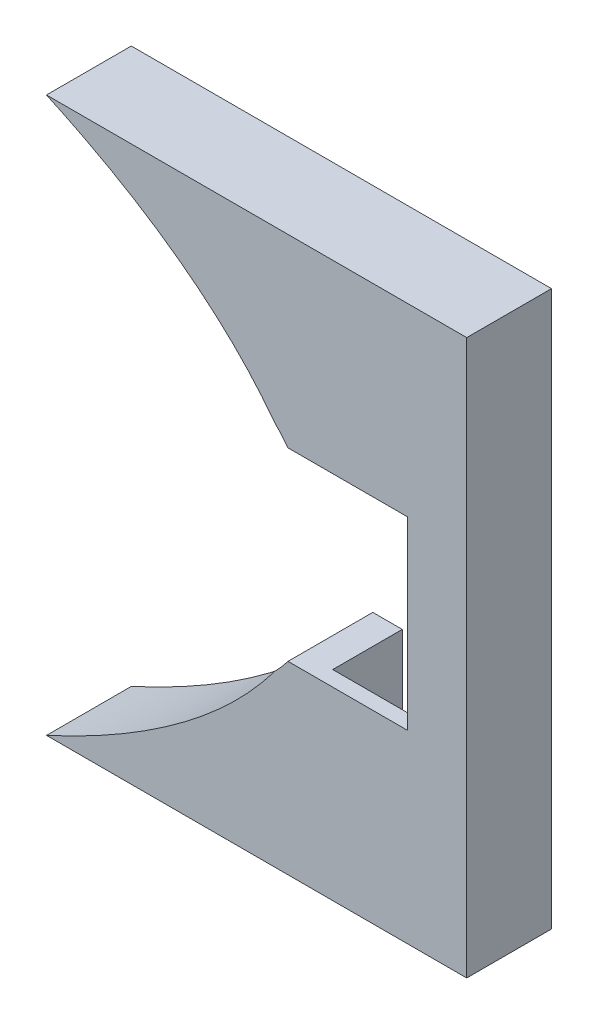
ISO-10303-21;
HEADER;
FILE_DESCRIPTION(('STEP AP214'),'2;1');
FILE_NAME('part.step','',(''),(''),'','','');
FILE_SCHEMA(('AUTOMOTIVE_DESIGN { 1 0 10303 214 1 1 1 1 }'));
ENDSEC;
DATA;
#1=APPLICATION_CONTEXT('core data for automotive mechanical design processes');
#2=APPLICATION_PROTOCOL_DEFINITION('international standard','automotive_design',2000,#1);
#3=PRODUCT_CONTEXT('',#1,'mechanical');
#4=PRODUCT('Part','Part','',(#3));
#5=PRODUCT_RELATED_PRODUCT_CATEGORY('part','',(#4));
#6=PRODUCT_DEFINITION_FORMATION('','',#4);
#7=PRODUCT_DEFINITION_CONTEXT('part definition',#1,'design');
#8=PRODUCT_DEFINITION('design','',#6,#7);
#9=PRODUCT_DEFINITION_SHAPE('','',#8);
#10=(LENGTH_UNIT() NAMED_UNIT(*) SI_UNIT(.MILLI.,.METRE.));
#11=(NAMED_UNIT(*) PLANE_ANGLE_UNIT() SI_UNIT($,.RADIAN.));
#12=(NAMED_UNIT(*) SI_UNIT($,.STERADIAN.) SOLID_ANGLE_UNIT());
#13=UNCERTAINTY_MEASURE_WITH_UNIT(LENGTH_MEASURE(1.E-05),#10,'distance_accuracy_value','');
#14=(GEOMETRIC_REPRESENTATION_CONTEXT(3) GLOBAL_UNCERTAINTY_ASSIGNED_CONTEXT((#13)) GLOBAL_UNIT_ASSIGNED_CONTEXT((#10,
#11,#12)) REPRESENTATION_CONTEXT('',''));
#15=CARTESIAN_POINT('',(0.,0.,0.));
#16=DIRECTION('',(0.,0.,1.));
#17=DIRECTION('',(1.,0.,0.));
#18=AXIS2_PLACEMENT_3D('',#15,#16,#17);
#19=CARTESIAN_POINT('',(55.8,-5.47541809871952E-13,-3.3));
#20=DIRECTION('',(-1.,0.,0.));
#21=DIRECTION('',(0.,-1.,0.));
#22=AXIS2_PLACEMENT_3D('',#19,#20,#21);
#23=PLANE('',#22);
#24=DIRECTION('',(0.,1.,0.));
#25=VECTOR('',#24,1.);
#26=CARTESIAN_POINT('',(55.8,-5.47541809871952E-13,-0.9));
#27=LINE('',#26,#25);
#28=CARTESIAN_POINT('',(55.7999999999998,-14.8500000000006,-0.9));
#29=VERTEX_POINT('',#28);
#30=CARTESIAN_POINT('',(55.8000000000001,-5.44999999999937,-0.9));
#31=VERTEX_POINT('',#30);
#32=EDGE_CURVE('E59',#29,#31,#27,.T.);
#33=ORIENTED_EDGE('',*,*,#32,.F.);
#34=DIRECTION('',(0.,0.,1.));
#35=VECTOR('',#34,1.);
#36=CARTESIAN_POINT('',(55.7999999999998,-14.8500000000006,-3.3));
#37=LINE('',#36,#35);
#38=CARTESIAN_POINT('',(55.7999999999998,-14.8500000000006,-5.));
#39=VERTEX_POINT('',#38);
#40=EDGE_CURVE('E296',#39,#29,#37,.T.);
#41=ORIENTED_EDGE('',*,*,#40,.F.);
#42=DIRECTION('',(0.,1.,0.));
#43=VECTOR('',#42,1.);
#44=CARTESIAN_POINT('',(55.8,-5.47541809871952E-13,-5.));
#45=LINE('',#44,#43);
#46=CARTESIAN_POINT('',(55.7999999999999,-5.44999999999937,-5.));
#47=VERTEX_POINT('',#46);
#48=EDGE_CURVE('E358',#39,#47,#45,.T.);
#49=ORIENTED_EDGE('',*,*,#48,.T.);
#50=DIRECTION('',(0.,0.,1.));
#51=VECTOR('',#50,1.);
#52=CARTESIAN_POINT('',(55.8000000000001,-5.44999999999937,-3.3));
#53=LINE('',#52,#51);
#54=EDGE_CURVE('E55',#47,#31,#53,.T.);
#55=ORIENTED_EDGE('',*,*,#54,.T.);
#56=EDGE_LOOP('',(#33,#41,#49,#55));
#57=FACE_BOUND('',#56,.T.);
#58=ADVANCED_FACE('F37',(#57),#23,.F.);
#59=CARTESIAN_POINT('',(-1.72913909218427E-13,-14.8499999999999,-3.3));
#60=DIRECTION('',(0.,-1.,0.));
#61=DIRECTION('',(1.,0.,0.));
#62=AXIS2_PLACEMENT_3D('',#59,#60,#61);
#63=PLANE('',#62);
#64=DIRECTION('',(-1.,0.,0.));
#65=VECTOR('',#64,1.);
#66=CARTESIAN_POINT('',(-1.72913909218427E-13,-14.8499999999999,-0.9));
#67=LINE('',#66,#65);
#68=CARTESIAN_POINT('',(63.0999999999999,-14.8500000000007,-0.9));
#69=VERTEX_POINT('',#68);
#70=EDGE_CURVE('E182',#69,#29,#67,.T.);
#71=ORIENTED_EDGE('',*,*,#70,.F.);
#72=DIRECTION('',(0.,0.,1.));
#73=VECTOR('',#72,1.);
#74=CARTESIAN_POINT('',(63.0999999999999,-14.8500000000007,-3.3));
#75=LINE('',#74,#73);
#76=CARTESIAN_POINT('',(63.0999999999999,-14.8500000000007,-5.));
#77=VERTEX_POINT('',#76);
#78=EDGE_CURVE('E298',#77,#69,#75,.T.);
#79=ORIENTED_EDGE('',*,*,#78,.F.);
#80=DIRECTION('',(-1.,0.,0.));
#81=VECTOR('',#80,1.);
#82=CARTESIAN_POINT('',(-1.72913909218427E-13,-14.8499999999999,-5.));
#83=LINE('',#82,#81);
#84=EDGE_CURVE('E360',#77,#39,#83,.T.);
#85=ORIENTED_EDGE('',*,*,#84,.T.);
#86=ORIENTED_EDGE('',*,*,#40,.T.);
#87=EDGE_LOOP('',(#71,#79,#85,#86));
#88=FACE_BOUND('',#87,.T.);
#89=ADVANCED_FACE('F242',(#88),#63,.F.);
#90=CARTESIAN_POINT('',(63.1,-6.48658081980068E-13,-3.3));
#91=DIRECTION('',(1.,0.,0.));
#92=DIRECTION('',(0.,1.,0.));
#93=AXIS2_PLACEMENT_3D('',#90,#91,#92);
#94=PLANE('',#93);
#95=DIRECTION('',(0.,-1.,0.));
#96=VECTOR('',#95,1.);
#97=CARTESIAN_POINT('',(63.1,-6.48658081980068E-13,-0.9));
#98=LINE('',#97,#96);
#99=CARTESIAN_POINT('',(63.1000000000002,14.8499999999993,-0.9));
#100=VERTEX_POINT('',#99);
#101=EDGE_CURVE('E185',#100,#69,#98,.T.);
#102=ORIENTED_EDGE('',*,*,#101,.F.);
#103=DIRECTION('',(0.,0.,1.));
#104=VECTOR('',#103,1.);
#105=CARTESIAN_POINT('',(63.1000000000002,14.8499999999993,-3.3));
#106=LINE('',#105,#104);
#107=CARTESIAN_POINT('',(63.1000000000002,14.8499999999993,-5.));
#108=VERTEX_POINT('',#107);
#109=EDGE_CURVE('E301',#108,#100,#106,.T.);
#110=ORIENTED_EDGE('',*,*,#109,.F.);
#111=DIRECTION('',(0.,-1.,0.));
#112=VECTOR('',#111,1.);
#113=CARTESIAN_POINT('',(63.1,-6.48658081980068E-13,-5.));
#114=LINE('',#113,#112);
#115=EDGE_CURVE('E363',#108,#77,#114,.T.);
#116=ORIENTED_EDGE('',*,*,#115,.T.);
#117=ORIENTED_EDGE('',*,*,#78,.T.);
#118=EDGE_LOOP('',(#102,#110,#116,#117));
#119=FACE_BOUND('',#118,.T.);
#120=ADVANCED_FACE('F245',(#119),#94,.F.);
#121=CARTESIAN_POINT('',(1.5879848805774E-13,14.85,-3.3));
#122=DIRECTION('',(0.,1.,0.));
#123=DIRECTION('',(-1.,0.,0.));
#124=AXIS2_PLACEMENT_3D('',#121,#122,#123);
#125=PLANE('',#124);
#126=DIRECTION('',(1.,0.,0.));
#127=VECTOR('',#126,1.);
#128=CARTESIAN_POINT('',(1.5879848805774E-13,14.85,-0.9));
#129=LINE('',#128,#127);
#130=CARTESIAN_POINT('',(55.8000000000001,14.8499999999994,-0.9));
#131=VERTEX_POINT('',#130);
#132=EDGE_CURVE('E188',#131,#100,#129,.T.);
#133=ORIENTED_EDGE('',*,*,#132,.F.);
#134=DIRECTION('',(0.,0.,1.));
#135=VECTOR('',#134,1.);
#136=CARTESIAN_POINT('',(55.8000000000001,14.8499999999994,-3.3));
#137=LINE('',#136,#135);
#138=CARTESIAN_POINT('',(55.8000000000001,14.8499999999994,-5.));
#139=VERTEX_POINT('',#138);
#140=EDGE_CURVE('E304',#139,#131,#137,.T.);
#141=ORIENTED_EDGE('',*,*,#140,.F.);
#142=DIRECTION('',(1.,0.,0.));
#143=VECTOR('',#142,1.);
#144=CARTESIAN_POINT('',(1.5879848805774E-13,14.85,-5.));
#145=LINE('',#144,#143);
#146=EDGE_CURVE('E366',#139,#108,#145,.T.);
#147=ORIENTED_EDGE('',*,*,#146,.T.);
#148=ORIENTED_EDGE('',*,*,#109,.T.);
#149=EDGE_LOOP('',(#133,#141,#147,#148));
#150=FACE_BOUND('',#149,.T.);
#151=ADVANCED_FACE('F249',(#150),#125,.F.);
#152=CARTESIAN_POINT('',(55.8,-5.47541809871952E-13,-3.3));
#153=DIRECTION('',(-1.,0.,0.));
#154=DIRECTION('',(0.,-1.,0.));
#155=AXIS2_PLACEMENT_3D('',#152,#153,#154);
#156=PLANE('',#155);
#157=DIRECTION('',(0.,1.,0.));
#158=VECTOR('',#157,1.);
#159=CARTESIAN_POINT('',(55.8,-5.47541809871952E-13,-0.9));
#160=LINE('',#159,#158);
#161=CARTESIAN_POINT('',(55.8000000000001,5.44999999999937,-0.9));
#162=VERTEX_POINT('',#161);
#163=EDGE_CURVE('E191',#162,#131,#160,.T.);
#164=ORIENTED_EDGE('',*,*,#163,.F.);
#165=DIRECTION('',(0.,0.,1.));
#166=VECTOR('',#165,1.);
#167=CARTESIAN_POINT('',(55.8000000000001,5.44999999999937,-3.3));
#168=LINE('',#167,#166);
#169=CARTESIAN_POINT('',(55.8000000000001,5.44999999999937,-5.));
#170=VERTEX_POINT('',#169);
#171=EDGE_CURVE('E307',#170,#162,#168,.T.);
#172=ORIENTED_EDGE('',*,*,#171,.F.);
#173=DIRECTION('',(0.,1.,0.));
#174=VECTOR('',#173,1.);
#175=CARTESIAN_POINT('',(55.8,-5.47541809871952E-13,-5.));
#176=LINE('',#175,#174);
#177=EDGE_CURVE('E369',#170,#139,#176,.T.);
#178=ORIENTED_EDGE('',*,*,#177,.T.);
#179=ORIENTED_EDGE('',*,*,#140,.T.);
#180=EDGE_LOOP('',(#164,#172,#178,#179));
#181=FACE_BOUND('',#180,.T.);
#182=ADVANCED_FACE('F253',(#181),#156,.F.);
#183=CARTESIAN_POINT('',(53.263961030679,6.36396103067889,-3.3));
#184=CARTESIAN_POINT('',(41.904509181002,21.6051932608365,-3.3));
#185=CARTESIAN_POINT('',(7.80815290135852,25.0295585271866,-3.3));
#186=CARTESIAN_POINT('',(-2.68131998276124,23.8497489116771,-3.3));
#187=B_SPLINE_CURVE_WITH_KNOTS('',3,(#183,#184,#185,#186),.UNSPECIFIED.,.F.,.F.,(4,4),(0.,1.),.UNSPECIFIED.);
#188=DIRECTION('',(0.,0.,1.));
#189=VECTOR('',#188,1.);
#190=SURFACE_OF_LINEAR_EXTRUSION('',#187,#189);
#191=CARTESIAN_POINT('',(53.263961030679,6.36396103067889,0.));
#192=CARTESIAN_POINT('',(41.904509181002,21.6051932608365,0.));
#193=CARTESIAN_POINT('',(7.80815290135852,25.0295585271866,0.));
#194=CARTESIAN_POINT('',(-2.68131998276124,23.8497489116771,0.));
#195=B_SPLINE_CURVE_WITH_KNOTS('',3,(#191,#192,#193,#194),.UNSPECIFIED.,.F.,.F.,(4,4),(0.,1.),.UNSPECIFIED.);
#196=CARTESIAN_POINT('',(53.263961030679,6.3639610306789,0.));
#197=VERTEX_POINT('',#196);
#198=CARTESIAN_POINT('',(39.8224049245104,16.3499999999993,0.));
#199=VERTEX_POINT('',#198);
#200=EDGE_CURVE('E154',#197,#199,#195,.T.);
#201=ORIENTED_EDGE('',*,*,#200,.T.);
#202=DIRECTION('',(0.,0.,1.));
#203=VECTOR('',#202,1.);
#204=CARTESIAN_POINT('',(39.8224049245104,16.3499999999993,-3.3));
#205=LINE('',#204,#203);
#206=CARTESIAN_POINT('',(39.8224049245104,16.3499999999993,-5.00000000000001));
#207=VERTEX_POINT('',#206);
#208=EDGE_CURVE('E12',#207,#199,#205,.T.);
#209=ORIENTED_EDGE('',*,*,#208,.F.);
#210=CARTESIAN_POINT('',(53.263961030679,6.36396103067889,-5.00000000000001));
#211=CARTESIAN_POINT('',(41.904509181002,21.6051932608365,-5.00000000000001));
#212=CARTESIAN_POINT('',(7.80815290135852,25.0295585271866,-5.00000000000001));
#213=CARTESIAN_POINT('',(-2.68131998276124,23.8497489116771,-5.00000000000001));
#214=B_SPLINE_CURVE_WITH_KNOTS('',3,(#210,#211,#212,#213),.UNSPECIFIED.,.F.,.F.,(4,4),(0.,1.),.UNSPECIFIED.);
#215=CARTESIAN_POINT('',(53.263961030679,6.36396103067889,-5.00000000000001));
#216=VERTEX_POINT('',#215);
#217=EDGE_CURVE('E152',#207,#216,#214,.F.);
#218=ORIENTED_EDGE('',*,*,#217,.T.);
#219=DIRECTION('',(0.,0.,1.));
#220=VECTOR('',#219,1.);
#221=CARTESIAN_POINT('',(53.263961030679,6.3639610306789,-3.3));
#222=LINE('',#221,#220);
#223=EDGE_CURVE('E42',#216,#197,#222,.T.);
#224=ORIENTED_EDGE('',*,*,#223,.T.);
#225=EDGE_LOOP('',(#201,#209,#218,#224));
#226=FACE_BOUND('',#225,.T.);
#227=ADVANCED_FACE('F39',(#226),#190,.F.);
#228=CARTESIAN_POINT('',(0.,16.3499999999993,-3.3));
#229=DIRECTION('',(0.,1.,0.));
#230=DIRECTION('',(0.,0.,1.));
#231=AXIS2_PLACEMENT_3D('',#228,#229,#230);
#232=PLANE('',#231);
#233=DIRECTION('',(-1.,0.,0.));
#234=VECTOR('',#233,1.);
#235=CARTESIAN_POINT('',(0.,16.3499999999993,0.));
#236=LINE('',#235,#234);
#237=CARTESIAN_POINT('',(64.6000000000002,16.3499999999993,0.));
#238=VERTEX_POINT('',#237);
#239=EDGE_CURVE('E275',#238,#199,#236,.T.);
#240=ORIENTED_EDGE('',*,*,#239,.F.);
#241=DIRECTION('',(0.,0.,1.));
#242=VECTOR('',#241,1.);
#243=CARTESIAN_POINT('',(64.6000000000002,16.3499999999993,-3.3));
#244=LINE('',#243,#242);
#245=CARTESIAN_POINT('',(64.6000000000002,16.3499999999993,-5.));
#246=VERTEX_POINT('',#245);
#247=EDGE_CURVE('E47',#246,#238,#244,.T.);
#248=ORIENTED_EDGE('',*,*,#247,.F.);
#249=DIRECTION('',(-1.,0.,0.));
#250=VECTOR('',#249,1.);
#251=CARTESIAN_POINT('',(0.,16.3499999999993,-5.));
#252=LINE('',#251,#250);
#253=EDGE_CURVE('E165',#246,#207,#252,.T.);
#254=ORIENTED_EDGE('',*,*,#253,.T.);
#255=ORIENTED_EDGE('',*,*,#208,.T.);
#256=EDGE_LOOP('',(#240,#248,#254,#255));
#257=FACE_BOUND('',#256,.T.);
#258=ADVANCED_FACE('F171',(#257),#232,.T.);
#259=CARTESIAN_POINT('',(64.6000000000002,0.,-3.3));
#260=DIRECTION('',(1.,0.,0.));
#261=DIRECTION('',(0.,0.,-1.));
#262=AXIS2_PLACEMENT_3D('',#259,#260,#261);
#263=PLANE('',#262);
#264=DIRECTION('',(0.,1.,0.));
#265=VECTOR('',#264,1.);
#266=CARTESIAN_POINT('',(64.6000000000002,0.,0.));
#267=LINE('',#266,#265);
#268=CARTESIAN_POINT('',(64.6000000000002,-16.3499999999993,0.));
#269=VERTEX_POINT('',#268);
#270=EDGE_CURVE('E279',#269,#238,#267,.T.);
#271=ORIENTED_EDGE('',*,*,#270,.F.);
#272=DIRECTION('',(0.,0.,1.));
#273=VECTOR('',#272,1.);
#274=CARTESIAN_POINT('',(64.6000000000002,-16.3499999999993,-3.3));
#275=LINE('',#274,#273);
#276=CARTESIAN_POINT('',(64.6000000000002,-16.3499999999993,-5.));
#277=VERTEX_POINT('',#276);
#278=EDGE_CURVE('E286',#277,#269,#275,.T.);
#279=ORIENTED_EDGE('',*,*,#278,.F.);
#280=DIRECTION('',(0.,1.,0.));
#281=VECTOR('',#280,1.);
#282=CARTESIAN_POINT('',(64.6000000000002,0.,-5.));
#283=LINE('',#282,#281);
#284=EDGE_CURVE('E175',#277,#246,#283,.T.);
#285=ORIENTED_EDGE('',*,*,#284,.T.);
#286=ORIENTED_EDGE('',*,*,#247,.T.);
#287=EDGE_LOOP('',(#271,#279,#285,#286));
#288=FACE_BOUND('',#287,.T.);
#289=ADVANCED_FACE('F342',(#288),#263,.T.);
#290=CARTESIAN_POINT('',(0.,-16.3499999999993,-3.3));
#291=DIRECTION('',(0.,-1.,0.));
#292=DIRECTION('',(0.,0.,-1.));
#293=AXIS2_PLACEMENT_3D('',#290,#291,#292);
#294=PLANE('',#293);
#295=DIRECTION('',(1.,0.,0.));
#296=VECTOR('',#295,1.);
#297=CARTESIAN_POINT('',(0.,-16.3499999999993,0.));
#298=LINE('',#297,#296);
#299=CARTESIAN_POINT('',(39.8224049245104,-16.3499999999993,0.));
#300=VERTEX_POINT('',#299);
#301=EDGE_CURVE('E281',#300,#269,#298,.T.);
#302=ORIENTED_EDGE('',*,*,#301,.F.);
#303=DIRECTION('',(0.,0.,1.));
#304=VECTOR('',#303,1.);
#305=CARTESIAN_POINT('',(39.8224049245104,-16.3499999999993,-3.3));
#306=LINE('',#305,#304);
#307=CARTESIAN_POINT('',(39.8224049245089,-16.3500000000001,-5.00000000000001));
#308=VERTEX_POINT('',#307);
#309=EDGE_CURVE('E288',#308,#300,#306,.T.);
#310=ORIENTED_EDGE('',*,*,#309,.F.);
#311=DIRECTION('',(1.,0.,0.));
#312=VECTOR('',#311,1.);
#313=CARTESIAN_POINT('',(0.,-16.3499999999993,-5.));
#314=LINE('',#313,#312);
#315=EDGE_CURVE('E340',#308,#277,#314,.T.);
#316=ORIENTED_EDGE('',*,*,#315,.T.);
#317=ORIENTED_EDGE('',*,*,#278,.T.);
#318=EDGE_LOOP('',(#302,#310,#316,#317));
#319=FACE_BOUND('',#318,.T.);
#320=ADVANCED_FACE('F229',(#319),#294,.T.);
#321=CARTESIAN_POINT('',(-2.68131998276124,-23.8497489116771,-3.3));
#322=CARTESIAN_POINT('',(7.80815290135852,-25.0295585271866,-3.3));
#323=CARTESIAN_POINT('',(41.904509181002,-21.6051932608365,-3.3));
#324=CARTESIAN_POINT('',(53.263961030679,-6.36396103067889,-3.3));
#325=B_SPLINE_CURVE_WITH_KNOTS('',3,(#321,#322,#323,#324),.UNSPECIFIED.,.F.,.F.,(4,4),(0.,1.),.UNSPECIFIED.);
#326=DIRECTION('',(0.,0.,1.));
#327=VECTOR('',#326,1.);
#328=SURFACE_OF_LINEAR_EXTRUSION('',#325,#327);
#329=CARTESIAN_POINT('',(-2.68131998276124,-23.8497489116771,0.));
#330=CARTESIAN_POINT('',(7.80815290135852,-25.0295585271866,0.));
#331=CARTESIAN_POINT('',(41.904509181002,-21.6051932608365,0.));
#332=CARTESIAN_POINT('',(53.263961030679,-6.36396103067889,0.));
#333=B_SPLINE_CURVE_WITH_KNOTS('',3,(#329,#330,#331,#332),.UNSPECIFIED.,.F.,.F.,(4,4),(0.,1.),.UNSPECIFIED.);
#334=CARTESIAN_POINT('',(53.263961030679,-6.3639610306789,0.));
#335=VERTEX_POINT('',#334);
#336=EDGE_CURVE('E329',#300,#335,#333,.T.);
#337=ORIENTED_EDGE('',*,*,#336,.T.);
#338=DIRECTION('',(0.,0.,1.));
#339=VECTOR('',#338,1.);
#340=CARTESIAN_POINT('',(53.263961030679,-6.3639610306789,-3.3));
#341=LINE('',#340,#339);
#342=CARTESIAN_POINT('',(53.263961030679,-6.3639610306789,-5.));
#343=VERTEX_POINT('',#342);
#344=EDGE_CURVE('E290',#343,#335,#341,.T.);
#345=ORIENTED_EDGE('',*,*,#344,.F.);
#346=CARTESIAN_POINT('',(-2.68131998276124,-23.8497489116771,-5.00000000000001));
#347=CARTESIAN_POINT('',(7.80815290135852,-25.0295585271866,-5.00000000000001));
#348=CARTESIAN_POINT('',(41.904509181002,-21.6051932608365,-5.00000000000001));
#349=CARTESIAN_POINT('',(53.263961030679,-6.36396103067889,-5.00000000000001));
#350=B_SPLINE_CURVE_WITH_KNOTS('',3,(#346,#347,#348,#349),.UNSPECIFIED.,.F.,.F.,(4,4),(0.,1.),.UNSPECIFIED.);
#351=EDGE_CURVE('E343',#343,#308,#350,.F.);
#352=ORIENTED_EDGE('',*,*,#351,.T.);
#353=ORIENTED_EDGE('',*,*,#309,.T.);
#354=EDGE_LOOP('',(#337,#345,#352,#353));
#355=FACE_BOUND('',#354,.T.);
#356=ADVANCED_FACE('F224',(#355),#328,.F.);
#357=CARTESIAN_POINT('',(46.9,0.,-3.3));
#358=DIRECTION('',(0.,0.,1.));
#359=DIRECTION('',(1.,0.,0.));
#360=AXIS2_PLACEMENT_3D('',#357,#358,#359);
#361=CYLINDRICAL_SURFACE('',#360,9.);
#362=CARTESIAN_POINT('',(46.9,0.,0.));
#363=DIRECTION('',(0.,0.,1.));
#364=DIRECTION('',(1.,0.,0.));
#365=AXIS2_PLACEMENT_3D('',#362,#363,#364);
#366=CIRCLE('',#365,9.);
#367=CARTESIAN_POINT('',(54.0622273072004,-5.44999999999937,0.));
#368=VERTEX_POINT('',#367);
#369=EDGE_CURVE('E324',#335,#368,#366,.T.);
#370=ORIENTED_EDGE('',*,*,#369,.T.);
#371=DIRECTION('',(0.,0.,1.));
#372=VECTOR('',#371,1.);
#373=CARTESIAN_POINT('',(54.0622273072004,-5.44999999999937,-3.3));
#374=LINE('',#373,#372);
#375=CARTESIAN_POINT('',(54.0622273072004,-5.44999999999937,-5.));
#376=VERTEX_POINT('',#375);
#377=EDGE_CURVE('E293',#376,#368,#374,.T.);
#378=ORIENTED_EDGE('',*,*,#377,.F.);
#379=CARTESIAN_POINT('',(46.9,0.,-5.));
#380=DIRECTION('',(0.,0.,1.));
#381=DIRECTION('',(1.,0.,0.));
#382=AXIS2_PLACEMENT_3D('',#379,#380,#381);
#383=CIRCLE('',#382,9.);
#384=EDGE_CURVE('E345',#376,#343,#383,.F.);
#385=ORIENTED_EDGE('',*,*,#384,.T.);
#386=ORIENTED_EDGE('',*,*,#344,.T.);
#387=EDGE_LOOP('',(#370,#378,#385,#386));
#388=FACE_BOUND('',#387,.T.);
#389=ADVANCED_FACE('F228',(#388),#361,.F.);
#390=CARTESIAN_POINT('',(0.,-5.44999999999937,-3.3));
#391=DIRECTION('',(0.,1.,0.));
#392=DIRECTION('',(0.,0.,1.));
#393=AXIS2_PLACEMENT_3D('',#390,#391,#392);
#394=PLANE('',#393);
#395=DIRECTION('',(-1.,0.,0.));
#396=VECTOR('',#395,1.);
#397=CARTESIAN_POINT('',(0.,-5.44999999999937,0.));
#398=LINE('',#397,#396);
#399=CARTESIAN_POINT('',(61.0999999999999,-5.44999999999937,0.));
#400=VERTEX_POINT('',#399);
#401=EDGE_CURVE('E321',#400,#368,#398,.T.);
#402=ORIENTED_EDGE('',*,*,#401,.F.);
#403=DIRECTION('',(0.,0.,1.));
#404=VECTOR('',#403,1.);
#405=CARTESIAN_POINT('',(61.0999999999999,-5.44999999999937,-0.9));
#406=LINE('',#405,#404);
#407=CARTESIAN_POINT('',(61.0999999999999,-5.44999999999937,-0.9));
#408=VERTEX_POINT('',#407);
#409=EDGE_CURVE('E202',#408,#400,#406,.T.);
#410=ORIENTED_EDGE('',*,*,#409,.F.);
#411=DIRECTION('',(1.,0.,0.));
#412=VECTOR('',#411,1.);
#413=CARTESIAN_POINT('',(0.,-5.44999999999936,-0.9));
#414=LINE('',#413,#412);
#415=EDGE_CURVE('E177',#31,#408,#414,.T.);
#416=ORIENTED_EDGE('',*,*,#415,.F.);
#417=ORIENTED_EDGE('',*,*,#54,.F.);
#418=DIRECTION('',(-1.,0.,0.));
#419=VECTOR('',#418,1.);
#420=CARTESIAN_POINT('',(0.,-5.44999999999937,-5.));
#421=LINE('',#420,#419);
#422=EDGE_CURVE('E355',#47,#376,#421,.T.);
#423=ORIENTED_EDGE('',*,*,#422,.T.);
#424=ORIENTED_EDGE('',*,*,#377,.T.);
#425=EDGE_LOOP('',(#402,#410,#416,#417,#423,#424));
#426=FACE_BOUND('',#425,.T.);
#427=ADVANCED_FACE('F234',(#426),#394,.T.);
#428=CARTESIAN_POINT('',(0.,5.44999999999937,-3.3));
#429=DIRECTION('',(0.,1.,0.));
#430=DIRECTION('',(0.,0.,1.));
#431=AXIS2_PLACEMENT_3D('',#428,#429,#430);
#432=PLANE('',#431);
#433=DIRECTION('',(-1.,0.,0.));
#434=VECTOR('',#433,1.);
#435=CARTESIAN_POINT('',(0.,5.44999999999937,0.));
#436=LINE('',#435,#434);
#437=CARTESIAN_POINT('',(61.0999999999999,5.44999999999937,0.));
#438=VERTEX_POINT('',#437);
#439=CARTESIAN_POINT('',(54.0622273072004,5.44999999999937,0.));
#440=VERTEX_POINT('',#439);
#441=EDGE_CURVE('E274',#438,#440,#436,.T.);
#442=ORIENTED_EDGE('',*,*,#441,.T.);
#443=DIRECTION('',(0.,0.,1.));
#444=VECTOR('',#443,1.);
#445=CARTESIAN_POINT('',(54.0622273072004,5.44999999999937,-3.3));
#446=LINE('',#445,#444);
#447=CARTESIAN_POINT('',(54.0622273072004,5.44999999999937,-5.));
#448=VERTEX_POINT('',#447);
#449=EDGE_CURVE('E273',#448,#440,#446,.T.);
#450=ORIENTED_EDGE('',*,*,#449,.F.);
#451=DIRECTION('',(1.,0.,0.));
#452=VECTOR('',#451,1.);
#453=CARTESIAN_POINT('',(0.,5.44999999999937,-5.));
#454=LINE('',#453,#452);
#455=EDGE_CURVE('E311',#448,#170,#454,.T.);
#456=ORIENTED_EDGE('',*,*,#455,.T.);
#457=ORIENTED_EDGE('',*,*,#171,.T.);
#458=DIRECTION('',(1.,0.,0.));
#459=VECTOR('',#458,1.);
#460=CARTESIAN_POINT('',(0.,5.44999999999936,-0.9));
#461=LINE('',#460,#459);
#462=CARTESIAN_POINT('',(61.0999999999999,5.44999999999937,-0.9));
#463=VERTEX_POINT('',#462);
#464=EDGE_CURVE('E194',#162,#463,#461,.T.);
#465=ORIENTED_EDGE('',*,*,#464,.T.);
#466=DIRECTION('',(0.,0.,1.));
#467=VECTOR('',#466,1.);
#468=CARTESIAN_POINT('',(61.0999999999999,5.44999999999937,-0.9));
#469=LINE('',#468,#467);
#470=EDGE_CURVE('E199',#463,#438,#469,.T.);
#471=ORIENTED_EDGE('',*,*,#470,.T.);
#472=EDGE_LOOP('',(#442,#450,#456,#457,#465,#471));
#473=FACE_BOUND('',#472,.T.);
#474=ADVANCED_FACE('F238',(#473),#432,.F.);
#475=CARTESIAN_POINT('',(46.9,0.,-3.3));
#476=DIRECTION('',(0.,0.,1.));
#477=DIRECTION('',(1.,0.,0.));
#478=AXIS2_PLACEMENT_3D('',#475,#476,#477);
#479=CYLINDRICAL_SURFACE('',#478,9.);
#480=CARTESIAN_POINT('',(46.9,0.,0.));
#481=DIRECTION('',(0.,0.,1.));
#482=DIRECTION('',(1.,0.,0.));
#483=AXIS2_PLACEMENT_3D('',#480,#481,#482);
#484=CIRCLE('',#483,9.);
#485=EDGE_CURVE('E272',#440,#197,#484,.T.);
#486=ORIENTED_EDGE('',*,*,#485,.T.);
#487=ORIENTED_EDGE('',*,*,#223,.F.);
#488=CARTESIAN_POINT('',(46.9,0.,-5.));
#489=DIRECTION('',(0.,0.,1.));
#490=DIRECTION('',(1.,0.,0.));
#491=AXIS2_PLACEMENT_3D('',#488,#489,#490);
#492=CIRCLE('',#491,9.);
#493=EDGE_CURVE('E169',#216,#448,#492,.F.);
#494=ORIENTED_EDGE('',*,*,#493,.T.);
#495=ORIENTED_EDGE('',*,*,#449,.T.);
#496=EDGE_LOOP('',(#486,#487,#494,#495));
#497=FACE_BOUND('',#496,.T.);
#498=ADVANCED_FACE('F259',(#497),#479,.F.);
#499=CARTESIAN_POINT('',(0.,0.,0.));
#500=DIRECTION('',(0.,0.,1.));
#501=DIRECTION('',(1.,0.,0.));
#502=AXIS2_PLACEMENT_3D('',#499,#500,#501);
#503=PLANE('',#502);
#504=ORIENTED_EDGE('',*,*,#441,.F.);
#505=DIRECTION('',(0.,1.,0.));
#506=VECTOR('',#505,1.);
#507=CARTESIAN_POINT('',(61.0999999999999,0.,0.));
#508=LINE('',#507,#506);
#509=EDGE_CURVE('E180',#400,#438,#508,.T.);
#510=ORIENTED_EDGE('',*,*,#509,.F.);
#511=ORIENTED_EDGE('',*,*,#401,.T.);
#512=ORIENTED_EDGE('',*,*,#369,.F.);
#513=ORIENTED_EDGE('',*,*,#336,.F.);
#514=ORIENTED_EDGE('',*,*,#301,.T.);
#515=ORIENTED_EDGE('',*,*,#270,.T.);
#516=ORIENTED_EDGE('',*,*,#239,.T.);
#517=ORIENTED_EDGE('',*,*,#200,.F.);
#518=ORIENTED_EDGE('',*,*,#485,.F.);
#519=EDGE_LOOP('',(#504,#510,#511,#512,#513,#514,#515,#516,#517,#518));
#520=FACE_BOUND('',#519,.T.);
#521=ADVANCED_FACE('F262',(#520),#503,.T.);
#522=CARTESIAN_POINT('',(61.0999999999999,0.,-0.9));
#523=DIRECTION('',(1.,0.,0.));
#524=DIRECTION('',(0.,0.,-1.));
#525=AXIS2_PLACEMENT_3D('',#522,#523,#524);
#526=PLANE('',#525);
#527=ORIENTED_EDGE('',*,*,#509,.T.);
#528=ORIENTED_EDGE('',*,*,#470,.F.);
#529=DIRECTION('',(0.,1.,0.));
#530=VECTOR('',#529,1.);
#531=CARTESIAN_POINT('',(61.0999999999999,0.,-0.9));
#532=LINE('',#531,#530);
#533=EDGE_CURVE('E197',#408,#463,#532,.T.);
#534=ORIENTED_EDGE('',*,*,#533,.F.);
#535=ORIENTED_EDGE('',*,*,#409,.T.);
#536=EDGE_LOOP('',(#527,#528,#534,#535));
#537=FACE_BOUND('',#536,.T.);
#538=ADVANCED_FACE('F267',(#537),#526,.F.);
#539=CARTESIAN_POINT('',(0.,0.,-0.9));
#540=DIRECTION('',(0.,0.,1.));
#541=DIRECTION('',(1.,0.,0.));
#542=AXIS2_PLACEMENT_3D('',#539,#540,#541);
#543=PLANE('',#542);
#544=ORIENTED_EDGE('',*,*,#415,.T.);
#545=ORIENTED_EDGE('',*,*,#533,.T.);
#546=ORIENTED_EDGE('',*,*,#464,.F.);
#547=ORIENTED_EDGE('',*,*,#163,.T.);
#548=ORIENTED_EDGE('',*,*,#132,.T.);
#549=ORIENTED_EDGE('',*,*,#101,.T.);
#550=ORIENTED_EDGE('',*,*,#70,.T.);
#551=ORIENTED_EDGE('',*,*,#32,.T.);
#552=EDGE_LOOP('',(#544,#545,#546,#547,#548,#549,#550,#551));
#553=FACE_BOUND('',#552,.T.);
#554=ADVANCED_FACE('F315',(#553),#543,.F.);
#555=CARTESIAN_POINT('',(0.,0.,-5.));
#556=DIRECTION('',(0.,0.,1.));
#557=DIRECTION('',(1.,0.,0.));
#558=AXIS2_PLACEMENT_3D('',#555,#556,#557);
#559=PLANE('',#558);
#560=ORIENTED_EDGE('',*,*,#315,.F.);
#561=ORIENTED_EDGE('',*,*,#351,.F.);
#562=ORIENTED_EDGE('',*,*,#384,.F.);
#563=ORIENTED_EDGE('',*,*,#422,.F.);
#564=ORIENTED_EDGE('',*,*,#48,.F.);
#565=ORIENTED_EDGE('',*,*,#84,.F.);
#566=ORIENTED_EDGE('',*,*,#115,.F.);
#567=ORIENTED_EDGE('',*,*,#146,.F.);
#568=ORIENTED_EDGE('',*,*,#177,.F.);
#569=ORIENTED_EDGE('',*,*,#455,.F.);
#570=ORIENTED_EDGE('',*,*,#493,.F.);
#571=ORIENTED_EDGE('',*,*,#217,.F.);
#572=ORIENTED_EDGE('',*,*,#253,.F.);
#573=ORIENTED_EDGE('',*,*,#284,.F.);
#574=EDGE_LOOP('',(#560,#561,#562,#563,#564,#565,#566,#567,#568,#569,#570,#571,#572,#573));
#575=FACE_BOUND('',#574,.T.);
#576=ADVANCED_FACE('F163',(#575),#559,.F.);
#577=CLOSED_SHELL('',(#58,#89,#120,#151,#182,#227,#258,#289,#320,#356,#389,#427,#474,#498,#521,
#538,#554,#576));
#578=MANIFOLD_SOLID_BREP('B2',#577);
#579=ADVANCED_BREP_SHAPE_REPRESENTATION('',(#18,#578),#14);
#580=SHAPE_DEFINITION_REPRESENTATION(#9,#579);
ENDSEC;
END-ISO-10303-21;
